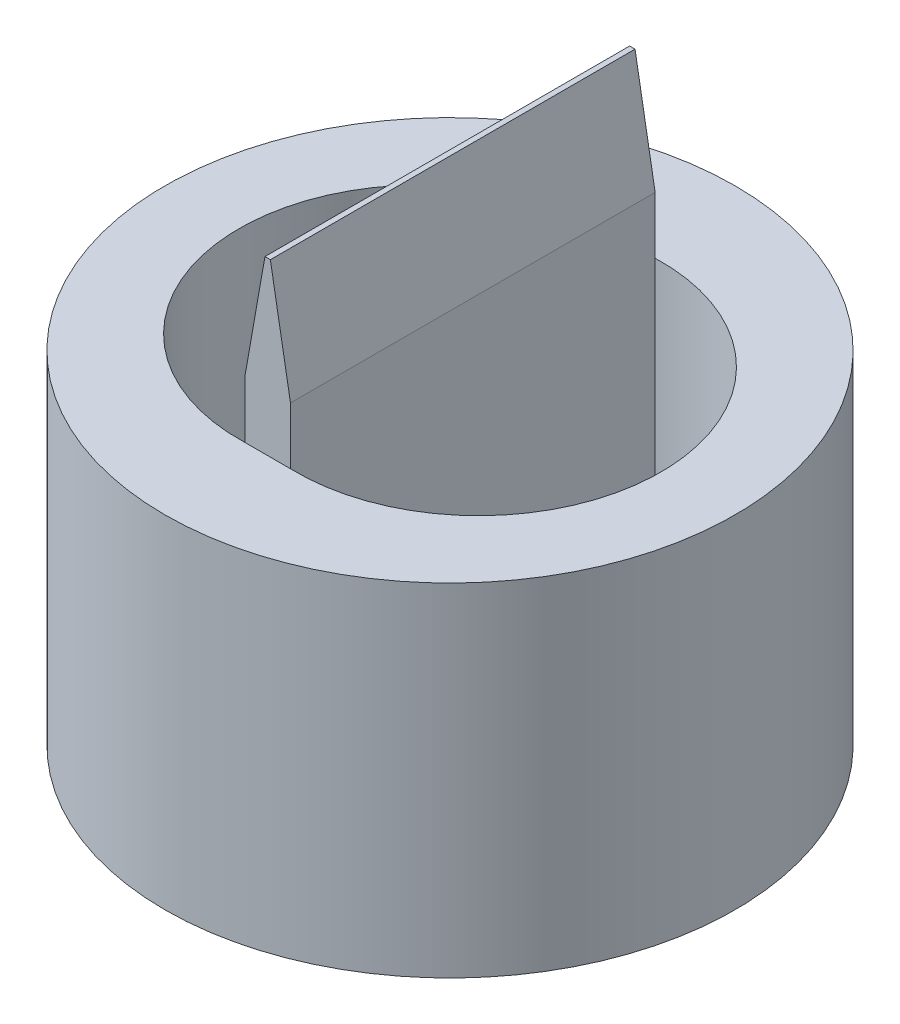
ISO-10303-21;
HEADER;
FILE_DESCRIPTION(('STEP AP214'),'2;1');
FILE_NAME('part.step','',(''),(''),'','','');
FILE_SCHEMA(('AUTOMOTIVE_DESIGN { 1 0 10303 214 1 1 1 1 }'));
ENDSEC;
DATA;
#1=APPLICATION_CONTEXT('core data for automotive mechanical design processes');
#2=APPLICATION_PROTOCOL_DEFINITION('international standard','automotive_design',2000,#1);
#3=PRODUCT_CONTEXT('',#1,'mechanical');
#4=PRODUCT('Part','Part','',(#3));
#5=PRODUCT_RELATED_PRODUCT_CATEGORY('part','',(#4));
#6=PRODUCT_DEFINITION_FORMATION('','',#4);
#7=PRODUCT_DEFINITION_CONTEXT('part definition',#1,'design');
#8=PRODUCT_DEFINITION('design','',#6,#7);
#9=PRODUCT_DEFINITION_SHAPE('','',#8);
#10=(LENGTH_UNIT() NAMED_UNIT(*) SI_UNIT(.MILLI.,.METRE.));
#11=(NAMED_UNIT(*) PLANE_ANGLE_UNIT() SI_UNIT($,.RADIAN.));
#12=(NAMED_UNIT(*) SI_UNIT($,.STERADIAN.) SOLID_ANGLE_UNIT());
#13=UNCERTAINTY_MEASURE_WITH_UNIT(LENGTH_MEASURE(1.E-05),#10,'distance_accuracy_value','');
#14=(GEOMETRIC_REPRESENTATION_CONTEXT(3) GLOBAL_UNCERTAINTY_ASSIGNED_CONTEXT((#13)) GLOBAL_UNIT_ASSIGNED_CONTEXT((#10,
#11,#12)) REPRESENTATION_CONTEXT('',''));
#15=CARTESIAN_POINT('',(0.,0.,0.));
#16=DIRECTION('',(0.,0.,1.));
#17=DIRECTION('',(1.,0.,0.));
#18=AXIS2_PLACEMENT_3D('',#15,#16,#17);
#19=CARTESIAN_POINT('',(0.,6.,0.));
#20=DIRECTION('',(0.,-1.,0.));
#21=DIRECTION('',(0.,0.,-1.));
#22=AXIS2_PLACEMENT_3D('',#19,#20,#21);
#23=CYLINDRICAL_SURFACE('',#22,5.);
#24=CARTESIAN_POINT('',(0.,6.,0.));
#25=DIRECTION('',(0.,1.,0.));
#26=DIRECTION('',(0.,0.,1.));
#27=AXIS2_PLACEMENT_3D('',#24,#25,#26);
#28=CIRCLE('',#27,5.);
#29=CARTESIAN_POINT('',(0.,6.,5.));
#30=VERTEX_POINT('',#29);
#31=EDGE_CURVE('E161',#30,#30,#28,.T.);
#32=ORIENTED_EDGE('',*,*,#31,.F.);
#33=EDGE_LOOP('',(#32));
#34=FACE_BOUND('',#33,.T.);
#35=CARTESIAN_POINT('',(0.,0.,0.));
#36=DIRECTION('',(0.,1.,0.));
#37=DIRECTION('',(0.,0.,1.));
#38=AXIS2_PLACEMENT_3D('',#35,#36,#37);
#39=CIRCLE('',#38,5.);
#40=CARTESIAN_POINT('',(0.,0.,5.));
#41=VERTEX_POINT('',#40);
#42=EDGE_CURVE('E129',#41,#41,#39,.T.);
#43=ORIENTED_EDGE('',*,*,#42,.T.);
#44=EDGE_LOOP('',(#43));
#45=FACE_BOUND('',#44,.T.);
#46=ADVANCED_FACE('F35',(#34,#45),#23,.T.);
#47=CARTESIAN_POINT('',(0.,6.,0.));
#48=DIRECTION('',(0.,1.,0.));
#49=DIRECTION('',(0.,0.,1.));
#50=AXIS2_PLACEMENT_3D('',#47,#48,#49);
#51=PLANE('',#50);
#52=DIRECTION('',(1.,0.,0.));
#53=VECTOR('',#52,1.);
#54=CARTESIAN_POINT('',(-0.4,6.,3.19844649553726));
#55=LINE('',#54,#53);
#56=CARTESIAN_POINT('',(-0.4,6.,3.19844649553726));
#57=VERTEX_POINT('',#56);
#58=CARTESIAN_POINT('',(0.4,6.,3.19844649553726));
#59=VERTEX_POINT('',#58);
#60=EDGE_CURVE('E120',#57,#59,#55,.T.);
#61=ORIENTED_EDGE('',*,*,#60,.F.);
#62=CARTESIAN_POINT('',(-0.49969962480084,6.,0.));
#63=DIRECTION('',(0.,1.,0.));
#64=DIRECTION('',(0.,0.,-1.));
#65=AXIS2_PLACEMENT_3D('',#62,#63,#64);
#66=CIRCLE('',#65,3.2);
#67=CARTESIAN_POINT('',(-0.4,6.,-3.19844649553726));
#68=VERTEX_POINT('',#67);
#69=EDGE_CURVE('E113',#68,#57,#66,.T.);
#70=ORIENTED_EDGE('',*,*,#69,.F.);
#71=DIRECTION('',(-1.,0.,0.));
#72=VECTOR('',#71,1.);
#73=CARTESIAN_POINT('',(-0.4,6.,-3.19844649553726));
#74=LINE('',#73,#72);
#75=CARTESIAN_POINT('',(0.4,6.,-3.19844649553726));
#76=VERTEX_POINT('',#75);
#77=EDGE_CURVE('E117',#76,#68,#74,.T.);
#78=ORIENTED_EDGE('',*,*,#77,.F.);
#79=CARTESIAN_POINT('',(0.49969962480084,6.,0.));
#80=DIRECTION('',(0.,1.,0.));
#81=DIRECTION('',(0.,0.,-1.));
#82=AXIS2_PLACEMENT_3D('',#79,#80,#81);
#83=CIRCLE('',#82,3.2);
#84=EDGE_CURVE('E144',#59,#76,#83,.T.);
#85=ORIENTED_EDGE('',*,*,#84,.F.);
#86=EDGE_LOOP('',(#61,#70,#78,#85));
#87=FACE_BOUND('',#86,.T.);
#88=ORIENTED_EDGE('',*,*,#31,.T.);
#89=EDGE_LOOP('',(#88));
#90=FACE_BOUND('',#89,.T.);
#91=ADVANCED_FACE('F114',(#87,#90),#51,.T.);
#92=CARTESIAN_POINT('',(0.,0.,0.));
#93=DIRECTION('',(0.,1.,0.));
#94=DIRECTION('',(0.,0.,1.));
#95=AXIS2_PLACEMENT_3D('',#92,#93,#94);
#96=PLANE('',#95);
#97=ORIENTED_EDGE('',*,*,#42,.F.);
#98=EDGE_LOOP('',(#97));
#99=FACE_BOUND('',#98,.T.);
#100=ADVANCED_FACE('F207',(#99),#96,.F.);
#101=CARTESIAN_POINT('',(-0.49969962480084,2.,0.));
#102=DIRECTION('',(0.,1.,0.));
#103=DIRECTION('',(0.,0.,1.));
#104=AXIS2_PLACEMENT_3D('',#101,#102,#103);
#105=CYLINDRICAL_SURFACE('',#104,3.2);
#106=ORIENTED_EDGE('',*,*,#69,.T.);
#107=DIRECTION('',(0.,1.,0.));
#108=VECTOR('',#107,1.);
#109=CARTESIAN_POINT('',(-0.4,2.,3.19844649553726));
#110=LINE('',#109,#108);
#111=CARTESIAN_POINT('',(-0.4,2.,3.19844649553726));
#112=VERTEX_POINT('',#111);
#113=EDGE_CURVE('E130',#112,#57,#110,.T.);
#114=ORIENTED_EDGE('',*,*,#113,.F.);
#115=CARTESIAN_POINT('',(-0.49969962480084,2.,0.));
#116=DIRECTION('',(0.,1.,0.));
#117=DIRECTION('',(0.,0.,-1.));
#118=AXIS2_PLACEMENT_3D('',#115,#116,#117);
#119=CIRCLE('',#118,3.2);
#120=CARTESIAN_POINT('',(-0.4,2.,-3.19844649553726));
#121=VERTEX_POINT('',#120);
#122=EDGE_CURVE('E123',#121,#112,#119,.T.);
#123=ORIENTED_EDGE('',*,*,#122,.F.);
#124=DIRECTION('',(0.,1.,0.));
#125=VECTOR('',#124,1.);
#126=CARTESIAN_POINT('',(-0.4,2.,-3.19844649553726));
#127=LINE('',#126,#125);
#128=EDGE_CURVE('E102',#121,#68,#127,.T.);
#129=ORIENTED_EDGE('',*,*,#128,.T.);
#130=EDGE_LOOP('',(#106,#114,#123,#129));
#131=FACE_BOUND('',#130,.T.);
#132=ADVANCED_FACE('F126',(#131),#105,.F.);
#133=CARTESIAN_POINT('',(-0.4,2.,-3.19844649553726));
#134=DIRECTION('',(1.,0.,0.));
#135=DIRECTION('',(0.,0.,-1.));
#136=AXIS2_PLACEMENT_3D('',#133,#134,#135);
#137=PLANE('',#136);
#138=DIRECTION('',(0.,-1.,0.));
#139=VECTOR('',#138,1.);
#140=CARTESIAN_POINT('',(-0.4,9.,3.19844649553726));
#141=LINE('',#140,#139);
#142=CARTESIAN_POINT('',(-0.4,6.99999999999996,3.19844649553726));
#143=VERTEX_POINT('',#142);
#144=EDGE_CURVE('E107',#143,#57,#141,.T.);
#145=ORIENTED_EDGE('',*,*,#144,.F.);
#146=DIRECTION('',(0.,0.,-1.));
#147=VECTOR('',#146,1.);
#148=CARTESIAN_POINT('',(-0.4,6.99999999999996,-3.19844649553726));
#149=LINE('',#148,#147);
#150=CARTESIAN_POINT('',(-0.4,6.99999999999996,-3.19844649553726));
#151=VERTEX_POINT('',#150);
#152=EDGE_CURVE('E58',#143,#151,#149,.T.);
#153=ORIENTED_EDGE('',*,*,#152,.T.);
#154=DIRECTION('',(0.,-1.,0.));
#155=VECTOR('',#154,1.);
#156=CARTESIAN_POINT('',(-0.4,9.,-3.19844649553726));
#157=LINE('',#156,#155);
#158=EDGE_CURVE('E97',#151,#68,#157,.T.);
#159=ORIENTED_EDGE('',*,*,#158,.T.);
#160=ORIENTED_EDGE('',*,*,#128,.F.);
#161=DIRECTION('',(0.,0.,-1.));
#162=VECTOR('',#161,1.);
#163=CARTESIAN_POINT('',(-0.4,2.,-3.19844649553726));
#164=LINE('',#163,#162);
#165=EDGE_CURVE('E158',#112,#121,#164,.T.);
#166=ORIENTED_EDGE('',*,*,#165,.F.);
#167=ORIENTED_EDGE('',*,*,#113,.T.);
#168=EDGE_LOOP('',(#145,#153,#159,#160,#166,#167));
#169=FACE_BOUND('',#168,.T.);
#170=ADVANCED_FACE('F99',(#169),#137,.F.);
#171=CARTESIAN_POINT('',(-0.49969962480084,2.,0.));
#172=DIRECTION('',(0.,-1.,0.));
#173=DIRECTION('',(0.,0.,-1.));
#174=AXIS2_PLACEMENT_3D('',#171,#172,#173);
#175=PLANE('',#174);
#176=ORIENTED_EDGE('',*,*,#122,.T.);
#177=ORIENTED_EDGE('',*,*,#165,.T.);
#178=EDGE_LOOP('',(#176,#177));
#179=FACE_BOUND('',#178,.T.);
#180=ADVANCED_FACE('F189',(#179),#175,.F.);
#181=CARTESIAN_POINT('',(0.49969962480084,2.,0.));
#182=DIRECTION('',(0.,1.,0.));
#183=DIRECTION('',(0.,0.,1.));
#184=AXIS2_PLACEMENT_3D('',#181,#182,#183);
#185=CYLINDRICAL_SURFACE('',#184,3.2);
#186=ORIENTED_EDGE('',*,*,#84,.T.);
#187=DIRECTION('',(0.,1.,0.));
#188=VECTOR('',#187,1.);
#189=CARTESIAN_POINT('',(0.4,2.,-3.19844649553726));
#190=LINE('',#189,#188);
#191=CARTESIAN_POINT('',(0.4,2.,-3.19844649553726));
#192=VERTEX_POINT('',#191);
#193=EDGE_CURVE('E151',#192,#76,#190,.T.);
#194=ORIENTED_EDGE('',*,*,#193,.F.);
#195=CARTESIAN_POINT('',(0.49969962480084,2.,0.));
#196=DIRECTION('',(0.,1.,0.));
#197=DIRECTION('',(0.,0.,-1.));
#198=AXIS2_PLACEMENT_3D('',#195,#196,#197);
#199=CIRCLE('',#198,3.2);
#200=CARTESIAN_POINT('',(0.4,2.,3.19844649553726));
#201=VERTEX_POINT('',#200);
#202=EDGE_CURVE('E145',#201,#192,#199,.T.);
#203=ORIENTED_EDGE('',*,*,#202,.F.);
#204=DIRECTION('',(0.,1.,0.));
#205=VECTOR('',#204,1.);
#206=CARTESIAN_POINT('',(0.4,2.,3.19844649553726));
#207=LINE('',#206,#205);
#208=EDGE_CURVE('E124',#201,#59,#207,.T.);
#209=ORIENTED_EDGE('',*,*,#208,.T.);
#210=EDGE_LOOP('',(#186,#194,#203,#209));
#211=FACE_BOUND('',#210,.T.);
#212=ADVANCED_FACE('F191',(#211),#185,.F.);
#213=CARTESIAN_POINT('',(0.4,2.,3.19844649553726));
#214=DIRECTION('',(-1.,0.,0.));
#215=DIRECTION('',(0.,0.,1.));
#216=AXIS2_PLACEMENT_3D('',#213,#214,#215);
#217=PLANE('',#216);
#218=DIRECTION('',(0.,-1.,0.));
#219=VECTOR('',#218,1.);
#220=CARTESIAN_POINT('',(0.4,9.,-3.19844649553726));
#221=LINE('',#220,#219);
#222=CARTESIAN_POINT('',(0.4,6.99999999999996,-3.19844649553726));
#223=VERTEX_POINT('',#222);
#224=EDGE_CURVE('E106',#223,#76,#221,.T.);
#225=ORIENTED_EDGE('',*,*,#224,.F.);
#226=DIRECTION('',(0.,0.,1.));
#227=VECTOR('',#226,1.);
#228=CARTESIAN_POINT('',(0.4,6.99999999999996,3.19844649553726));
#229=LINE('',#228,#227);
#230=CARTESIAN_POINT('',(0.4,6.99999999999996,3.19844649553726));
#231=VERTEX_POINT('',#230);
#232=EDGE_CURVE('E11',#223,#231,#229,.T.);
#233=ORIENTED_EDGE('',*,*,#232,.T.);
#234=DIRECTION('',(0.,-1.,0.));
#235=VECTOR('',#234,1.);
#236=CARTESIAN_POINT('',(0.4,9.,3.19844649553726));
#237=LINE('',#236,#235);
#238=EDGE_CURVE('E140',#231,#59,#237,.T.);
#239=ORIENTED_EDGE('',*,*,#238,.T.);
#240=ORIENTED_EDGE('',*,*,#208,.F.);
#241=DIRECTION('',(0.,0.,1.));
#242=VECTOR('',#241,1.);
#243=CARTESIAN_POINT('',(0.4,2.,3.19844649553726));
#244=LINE('',#243,#242);
#245=EDGE_CURVE('E148',#192,#201,#244,.T.);
#246=ORIENTED_EDGE('',*,*,#245,.F.);
#247=ORIENTED_EDGE('',*,*,#193,.T.);
#248=EDGE_LOOP('',(#225,#233,#239,#240,#246,#247));
#249=FACE_BOUND('',#248,.T.);
#250=ADVANCED_FACE('F197',(#249),#217,.F.);
#251=CARTESIAN_POINT('',(0.49969962480084,2.,0.));
#252=DIRECTION('',(0.,-1.,0.));
#253=DIRECTION('',(0.,0.,-1.));
#254=AXIS2_PLACEMENT_3D('',#251,#252,#253);
#255=PLANE('',#254);
#256=ORIENTED_EDGE('',*,*,#202,.T.);
#257=ORIENTED_EDGE('',*,*,#245,.T.);
#258=EDGE_LOOP('',(#256,#257));
#259=FACE_BOUND('',#258,.T.);
#260=ADVANCED_FACE('F226',(#259),#255,.F.);
#261=CARTESIAN_POINT('',(-0.4,9.,-3.19844649553726));
#262=DIRECTION('',(0.,0.,1.));
#263=DIRECTION('',(1.,0.,0.));
#264=AXIS2_PLACEMENT_3D('',#261,#262,#263);
#265=PLANE('',#264);
#266=ORIENTED_EDGE('',*,*,#158,.F.);
#267=DIRECTION('',(-0.173648177666927,-0.984807753012209,0.));
#268=VECTOR('',#267,1.);
#269=CARTESIAN_POINT('',(-0.0473460385830701,9.,-3.19844649553726));
#270=LINE('',#269,#268);
#271=CARTESIAN_POINT('',(-0.0473460385830701,9.,-3.19844649553726));
#272=VERTEX_POINT('',#271);
#273=EDGE_CURVE('E43',#151,#272,#270,.F.);
#274=ORIENTED_EDGE('',*,*,#273,.T.);
#275=DIRECTION('',(-1.,0.,0.));
#276=VECTOR('',#275,1.);
#277=CARTESIAN_POINT('',(-0.4,9.,-3.19844649553726));
#278=LINE('',#277,#276);
#279=CARTESIAN_POINT('',(0.0473460385830697,9.,-3.19844649553726));
#280=VERTEX_POINT('',#279);
#281=EDGE_CURVE('E134',#280,#272,#278,.T.);
#282=ORIENTED_EDGE('',*,*,#281,.F.);
#283=DIRECTION('',(-0.173648177666927,0.984807753012209,0.));
#284=VECTOR('',#283,1.);
#285=CARTESIAN_POINT('',(0.0473460385830697,9.,-3.19844649553726));
#286=LINE('',#285,#284);
#287=EDGE_CURVE('E50',#280,#223,#286,.F.);
#288=ORIENTED_EDGE('',*,*,#287,.T.);
#289=ORIENTED_EDGE('',*,*,#224,.T.);
#290=ORIENTED_EDGE('',*,*,#77,.T.);
#291=EDGE_LOOP('',(#266,#274,#282,#288,#289,#290));
#292=FACE_BOUND('',#291,.T.);
#293=ADVANCED_FACE('F132',(#292),#265,.F.);
#294=CARTESIAN_POINT('',(-0.4,9.,3.19844649553726));
#295=DIRECTION('',(0.,0.,-1.));
#296=DIRECTION('',(-1.,0.,0.));
#297=AXIS2_PLACEMENT_3D('',#294,#295,#296);
#298=PLANE('',#297);
#299=DIRECTION('',(1.,0.,0.));
#300=VECTOR('',#299,1.);
#301=CARTESIAN_POINT('',(-0.4,9.,3.19844649553726));
#302=LINE('',#301,#300);
#303=CARTESIAN_POINT('',(-0.0473460385830702,9.,3.19844649553726));
#304=VERTEX_POINT('',#303);
#305=CARTESIAN_POINT('',(0.0473460385830696,9.,3.19844649553726));
#306=VERTEX_POINT('',#305);
#307=EDGE_CURVE('E137',#304,#306,#302,.T.);
#308=ORIENTED_EDGE('',*,*,#307,.F.);
#309=DIRECTION('',(0.173648177666927,0.984807753012209,0.));
#310=VECTOR('',#309,1.);
#311=CARTESIAN_POINT('',(-0.0473460385830701,9.,3.19844649553726));
#312=LINE('',#311,#310);
#313=EDGE_CURVE('E174',#304,#143,#312,.F.);
#314=ORIENTED_EDGE('',*,*,#313,.T.);
#315=ORIENTED_EDGE('',*,*,#144,.T.);
#316=ORIENTED_EDGE('',*,*,#60,.T.);
#317=ORIENTED_EDGE('',*,*,#238,.F.);
#318=DIRECTION('',(0.173648177666927,-0.984807753012209,0.));
#319=VECTOR('',#318,1.);
#320=CARTESIAN_POINT('',(0.0473460385830697,9.,3.19844649553726));
#321=LINE('',#320,#319);
#322=EDGE_CURVE('E172',#231,#306,#321,.F.);
#323=ORIENTED_EDGE('',*,*,#322,.T.);
#324=EDGE_LOOP('',(#308,#314,#315,#316,#317,#323));
#325=FACE_BOUND('',#324,.T.);
#326=ADVANCED_FACE('F187',(#325),#298,.F.);
#327=CARTESIAN_POINT('',(0.,9.,0.));
#328=DIRECTION('',(0.,-1.,0.));
#329=DIRECTION('',(0.,0.,-1.));
#330=AXIS2_PLACEMENT_3D('',#327,#328,#329);
#331=PLANE('',#330);
#332=ORIENTED_EDGE('',*,*,#281,.T.);
#333=DIRECTION('',(0.,0.,1.));
#334=VECTOR('',#333,1.);
#335=CARTESIAN_POINT('',(-0.0473460385830701,9.,0.));
#336=LINE('',#335,#334);
#337=EDGE_CURVE('E169',#272,#304,#336,.T.);
#338=ORIENTED_EDGE('',*,*,#337,.T.);
#339=ORIENTED_EDGE('',*,*,#307,.T.);
#340=DIRECTION('',(0.,0.,-1.));
#341=VECTOR('',#340,1.);
#342=CARTESIAN_POINT('',(0.0473460385830697,9.,0.));
#343=LINE('',#342,#341);
#344=EDGE_CURVE('E164',#306,#280,#343,.T.);
#345=ORIENTED_EDGE('',*,*,#344,.T.);
#346=EDGE_LOOP('',(#332,#338,#339,#345));
#347=FACE_BOUND('',#346,.T.);
#348=ADVANCED_FACE('F181',(#347),#331,.F.);
#349=CARTESIAN_POINT('',(-0.0473460385830701,9.,0.));
#350=DIRECTION('',(0.984807753012209,-0.173648177666927,0.));
#351=DIRECTION('',(0.,0.,1.));
#352=AXIS2_PLACEMENT_3D('',#349,#350,#351);
#353=PLANE('',#352);
#354=ORIENTED_EDGE('',*,*,#273,.F.);
#355=ORIENTED_EDGE('',*,*,#152,.F.);
#356=ORIENTED_EDGE('',*,*,#313,.F.);
#357=ORIENTED_EDGE('',*,*,#337,.F.);
#358=EDGE_LOOP('',(#354,#355,#356,#357));
#359=FACE_BOUND('',#358,.T.);
#360=ADVANCED_FACE('F185',(#359),#353,.F.);
#361=CARTESIAN_POINT('',(0.0473460385830697,9.,0.));
#362=DIRECTION('',(-0.984807753012209,-0.173648177666927,0.));
#363=DIRECTION('',(0.,0.,-1.));
#364=AXIS2_PLACEMENT_3D('',#361,#362,#363);
#365=PLANE('',#364);
#366=ORIENTED_EDGE('',*,*,#322,.F.);
#367=ORIENTED_EDGE('',*,*,#232,.F.);
#368=ORIENTED_EDGE('',*,*,#287,.F.);
#369=ORIENTED_EDGE('',*,*,#344,.F.);
#370=EDGE_LOOP('',(#366,#367,#368,#369));
#371=FACE_BOUND('',#370,.T.);
#372=ADVANCED_FACE('F37',(#371),#365,.F.);
#373=CLOSED_SHELL('',(#46,#91,#100,#132,#170,#180,#212,#250,#260,#293,#326,#348,#360,#372));
#374=MANIFOLD_SOLID_BREP('B2',#373);
#375=ADVANCED_BREP_SHAPE_REPRESENTATION('',(#18,#374),#14);
#376=SHAPE_DEFINITION_REPRESENTATION(#9,#375);
ENDSEC;
END-ISO-10303-21;
